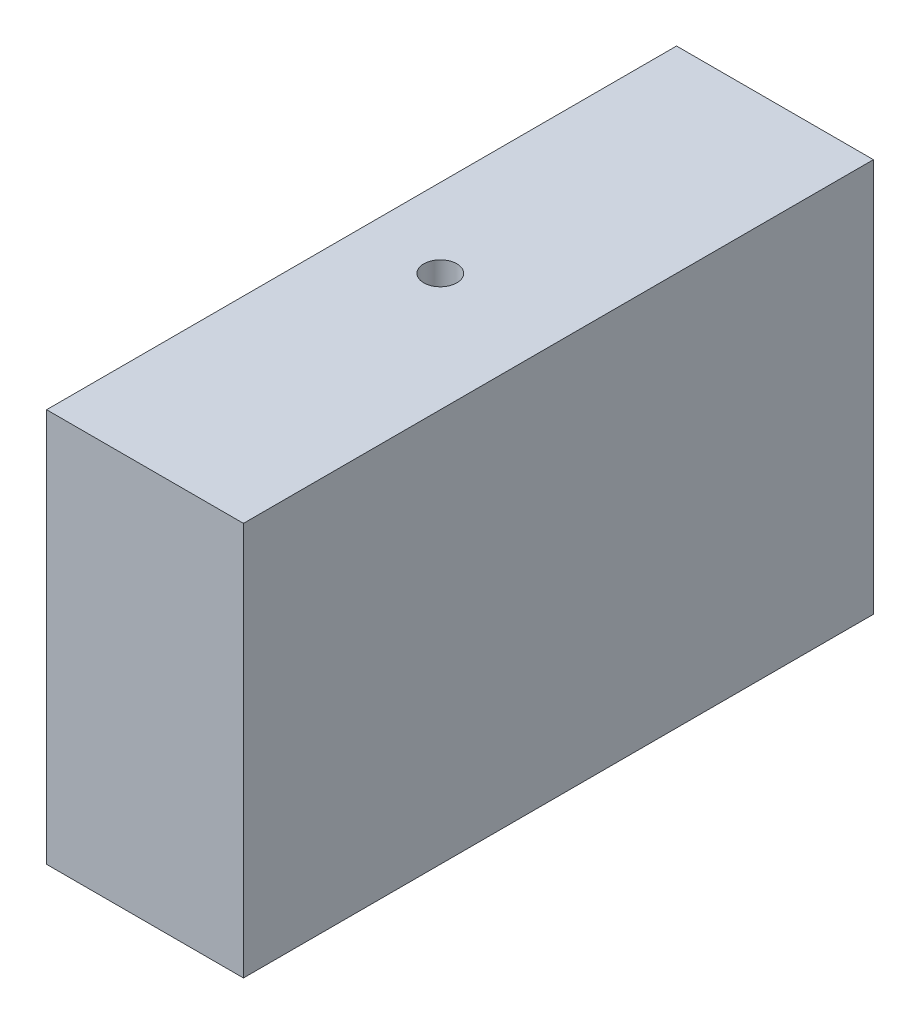
ISO-10303-21;
HEADER;
FILE_DESCRIPTION(('STEP AP214'),'2;1');
FILE_NAME('part.step','',(''),(''),'','','');
FILE_SCHEMA(('AUTOMOTIVE_DESIGN { 1 0 10303 214 1 1 1 1 }'));
ENDSEC;
DATA;
#1=APPLICATION_CONTEXT('core data for automotive mechanical design processes');
#2=APPLICATION_PROTOCOL_DEFINITION('international standard','automotive_design',2000,#1);
#3=PRODUCT_CONTEXT('',#1,'mechanical');
#4=PRODUCT('Part','Part','',(#3));
#5=PRODUCT_RELATED_PRODUCT_CATEGORY('part','',(#4));
#6=PRODUCT_DEFINITION_FORMATION('','',#4);
#7=PRODUCT_DEFINITION_CONTEXT('part definition',#1,'design');
#8=PRODUCT_DEFINITION('design','',#6,#7);
#9=PRODUCT_DEFINITION_SHAPE('','',#8);
#10=(LENGTH_UNIT() NAMED_UNIT(*) SI_UNIT(.MILLI.,.METRE.));
#11=(NAMED_UNIT(*) PLANE_ANGLE_UNIT() SI_UNIT($,.RADIAN.));
#12=(NAMED_UNIT(*) SI_UNIT($,.STERADIAN.) SOLID_ANGLE_UNIT());
#13=UNCERTAINTY_MEASURE_WITH_UNIT(LENGTH_MEASURE(1.E-05),#10,'distance_accuracy_value','');
#14=(GEOMETRIC_REPRESENTATION_CONTEXT(3) GLOBAL_UNCERTAINTY_ASSIGNED_CONTEXT((#13)) GLOBAL_UNIT_ASSIGNED_CONTEXT((#10,
#11,#12)) REPRESENTATION_CONTEXT('',''));
#15=CARTESIAN_POINT('',(0.,0.,0.));
#16=DIRECTION('',(0.,0.,1.));
#17=DIRECTION('',(1.,0.,0.));
#18=AXIS2_PLACEMENT_3D('',#15,#16,#17);
#19=CARTESIAN_POINT('',(-31.6318162864007,-17.693795620438,80.));
#20=DIRECTION('',(1.,0.,0.));
#21=DIRECTION('',(0.,0.,-1.));
#22=AXIS2_PLACEMENT_3D('',#19,#20,#21);
#23=PLANE('',#22);
#24=DIRECTION('',(0.,-1.,0.));
#25=VECTOR('',#24,1.);
#26=CARTESIAN_POINT('',(-31.6318162864007,-17.693795620438,0.));
#27=LINE('',#26,#25);
#28=CARTESIAN_POINT('',(-31.6318162864007,32.306204379562,0.));
#29=VERTEX_POINT('',#28);
#30=CARTESIAN_POINT('',(-31.6318162864007,-17.693795620438,0.));
#31=VERTEX_POINT('',#30);
#32=EDGE_CURVE('E108',#29,#31,#27,.T.);
#33=ORIENTED_EDGE('',*,*,#32,.T.);
#34=DIRECTION('',(0.,0.,-1.));
#35=VECTOR('',#34,1.);
#36=CARTESIAN_POINT('',(-31.6318162864007,-17.693795620438,80.));
#37=LINE('',#36,#35);
#38=CARTESIAN_POINT('',(-31.6318162864007,-17.693795620438,80.));
#39=VERTEX_POINT('',#38);
#40=EDGE_CURVE('E11',#39,#31,#37,.T.);
#41=ORIENTED_EDGE('',*,*,#40,.F.);
#42=DIRECTION('',(0.,-1.,0.));
#43=VECTOR('',#42,1.);
#44=CARTESIAN_POINT('',(-31.6318162864007,-17.693795620438,80.));
#45=LINE('',#44,#43);
#46=CARTESIAN_POINT('',(-31.6318162864007,32.306204379562,80.));
#47=VERTEX_POINT('',#46);
#48=EDGE_CURVE('E109',#47,#39,#45,.T.);
#49=ORIENTED_EDGE('',*,*,#48,.F.);
#50=DIRECTION('',(0.,0.,-1.));
#51=VECTOR('',#50,1.);
#52=CARTESIAN_POINT('',(-31.6318162864007,32.306204379562,80.));
#53=LINE('',#52,#51);
#54=EDGE_CURVE('E115',#47,#29,#53,.T.);
#55=ORIENTED_EDGE('',*,*,#54,.T.);
#56=EDGE_LOOP('',(#33,#41,#49,#55));
#57=FACE_BOUND('',#56,.T.);
#58=ADVANCED_FACE('F33',(#57),#23,.F.);
#59=CARTESIAN_POINT('',(-6.63181628640069,-17.693795620438,80.));
#60=DIRECTION('',(0.,1.,0.));
#61=DIRECTION('',(0.,0.,1.));
#62=AXIS2_PLACEMENT_3D('',#59,#60,#61);
#63=PLANE('',#62);
#64=CARTESIAN_POINT('',(-21.6318162864007,-17.693795620438,40.));
#65=DIRECTION('',(0.,-1.,0.));
#66=DIRECTION('',(0.,0.,-1.));
#67=AXIS2_PLACEMENT_3D('',#64,#65,#66);
#68=CIRCLE('',#67,2.09999999999999);
#69=CARTESIAN_POINT('',(-21.6318162864007,-17.693795620438,37.9));
#70=VERTEX_POINT('',#69);
#71=EDGE_CURVE('E98',#70,#70,#68,.T.);
#72=ORIENTED_EDGE('',*,*,#71,.F.);
#73=EDGE_LOOP('',(#72));
#74=FACE_BOUND('',#73,.T.);
#75=DIRECTION('',(1.,0.,0.));
#76=VECTOR('',#75,1.);
#77=CARTESIAN_POINT('',(-6.63181628640069,-17.693795620438,0.));
#78=LINE('',#77,#76);
#79=CARTESIAN_POINT('',(-6.63181628640069,-17.693795620438,0.));
#80=VERTEX_POINT('',#79);
#81=EDGE_CURVE('E118',#31,#80,#78,.T.);
#82=ORIENTED_EDGE('',*,*,#81,.T.);
#83=DIRECTION('',(0.,0.,-1.));
#84=VECTOR('',#83,1.);
#85=CARTESIAN_POINT('',(-6.63181628640069,-17.693795620438,80.));
#86=LINE('',#85,#84);
#87=CARTESIAN_POINT('',(-6.63181628640069,-17.693795620438,80.));
#88=VERTEX_POINT('',#87);
#89=EDGE_CURVE('E41',#88,#80,#86,.T.);
#90=ORIENTED_EDGE('',*,*,#89,.F.);
#91=DIRECTION('',(1.,0.,0.));
#92=VECTOR('',#91,1.);
#93=CARTESIAN_POINT('',(-6.63181628640069,-17.693795620438,80.));
#94=LINE('',#93,#92);
#95=EDGE_CURVE('E80',#39,#88,#94,.T.);
#96=ORIENTED_EDGE('',*,*,#95,.F.);
#97=ORIENTED_EDGE('',*,*,#40,.T.);
#98=EDGE_LOOP('',(#82,#90,#96,#97));
#99=FACE_BOUND('',#98,.T.);
#100=ADVANCED_FACE('F142',(#74,#99),#63,.F.);
#101=CARTESIAN_POINT('',(-6.63181628640069,32.306204379562,80.));
#102=DIRECTION('',(-1.,0.,0.));
#103=DIRECTION('',(0.,0.,1.));
#104=AXIS2_PLACEMENT_3D('',#101,#102,#103);
#105=PLANE('',#104);
#106=DIRECTION('',(0.,1.,0.));
#107=VECTOR('',#106,1.);
#108=CARTESIAN_POINT('',(-6.63181628640069,32.306204379562,0.));
#109=LINE('',#108,#107);
#110=CARTESIAN_POINT('',(-6.63181628640069,32.306204379562,0.));
#111=VERTEX_POINT('',#110);
#112=EDGE_CURVE('E67',#80,#111,#109,.T.);
#113=ORIENTED_EDGE('',*,*,#112,.T.);
#114=DIRECTION('',(0.,0.,-1.));
#115=VECTOR('',#114,1.);
#116=CARTESIAN_POINT('',(-6.63181628640069,32.306204379562,80.));
#117=LINE('',#116,#115);
#118=CARTESIAN_POINT('',(-6.63181628640069,32.306204379562,80.));
#119=VERTEX_POINT('',#118);
#120=EDGE_CURVE('E123',#119,#111,#117,.T.);
#121=ORIENTED_EDGE('',*,*,#120,.F.);
#122=DIRECTION('',(0.,1.,0.));
#123=VECTOR('',#122,1.);
#124=CARTESIAN_POINT('',(-6.63181628640069,32.306204379562,80.));
#125=LINE('',#124,#123);
#126=EDGE_CURVE('E112',#88,#119,#125,.T.);
#127=ORIENTED_EDGE('',*,*,#126,.F.);
#128=ORIENTED_EDGE('',*,*,#89,.T.);
#129=EDGE_LOOP('',(#113,#121,#127,#128));
#130=FACE_BOUND('',#129,.T.);
#131=ADVANCED_FACE('F125',(#130),#105,.F.);
#132=CARTESIAN_POINT('',(-31.6318162864007,32.306204379562,80.));
#133=DIRECTION('',(0.,-1.,0.));
#134=DIRECTION('',(0.,0.,-1.));
#135=AXIS2_PLACEMENT_3D('',#132,#133,#134);
#136=PLANE('',#135);
#137=CARTESIAN_POINT('',(-21.6318162864007,32.306204379562,40.));
#138=DIRECTION('',(0.,1.,0.));
#139=DIRECTION('',(0.,0.,1.));
#140=AXIS2_PLACEMENT_3D('',#137,#138,#139);
#141=CIRCLE('',#140,2.09999999999999);
#142=CARTESIAN_POINT('',(-21.6318162864007,32.306204379562,42.1));
#143=VERTEX_POINT('',#142);
#144=EDGE_CURVE('E97',#143,#143,#141,.T.);
#145=ORIENTED_EDGE('',*,*,#144,.F.);
#146=EDGE_LOOP('',(#145));
#147=FACE_BOUND('',#146,.T.);
#148=DIRECTION('',(-1.,0.,0.));
#149=VECTOR('',#148,1.);
#150=CARTESIAN_POINT('',(-31.6318162864007,32.306204379562,0.));
#151=LINE('',#150,#149);
#152=EDGE_CURVE('E73',#111,#29,#151,.T.);
#153=ORIENTED_EDGE('',*,*,#152,.T.);
#154=ORIENTED_EDGE('',*,*,#54,.F.);
#155=DIRECTION('',(-1.,0.,0.));
#156=VECTOR('',#155,1.);
#157=CARTESIAN_POINT('',(-31.6318162864007,32.306204379562,80.));
#158=LINE('',#157,#156);
#159=EDGE_CURVE('E49',#119,#47,#158,.T.);
#160=ORIENTED_EDGE('',*,*,#159,.F.);
#161=ORIENTED_EDGE('',*,*,#120,.T.);
#162=EDGE_LOOP('',(#153,#154,#160,#161));
#163=FACE_BOUND('',#162,.T.);
#164=ADVANCED_FACE('F132',(#147,#163),#136,.F.);
#165=CARTESIAN_POINT('',(0.,0.,80.));
#166=DIRECTION('',(0.,0.,-1.));
#167=DIRECTION('',(-1.,0.,0.));
#168=AXIS2_PLACEMENT_3D('',#165,#166,#167);
#169=PLANE('',#168);
#170=ORIENTED_EDGE('',*,*,#48,.T.);
#171=ORIENTED_EDGE('',*,*,#95,.T.);
#172=ORIENTED_EDGE('',*,*,#126,.T.);
#173=ORIENTED_EDGE('',*,*,#159,.T.);
#174=EDGE_LOOP('',(#170,#171,#172,#173));
#175=FACE_BOUND('',#174,.T.);
#176=ADVANCED_FACE('F134',(#175),#169,.F.);
#177=CARTESIAN_POINT('',(0.,0.,0.));
#178=DIRECTION('',(0.,0.,-1.));
#179=DIRECTION('',(-1.,0.,0.));
#180=AXIS2_PLACEMENT_3D('',#177,#178,#179);
#181=PLANE('',#180);
#182=ORIENTED_EDGE('',*,*,#32,.F.);
#183=ORIENTED_EDGE('',*,*,#152,.F.);
#184=ORIENTED_EDGE('',*,*,#112,.F.);
#185=ORIENTED_EDGE('',*,*,#81,.F.);
#186=EDGE_LOOP('',(#182,#183,#184,#185));
#187=FACE_BOUND('',#186,.T.);
#188=ADVANCED_FACE('F128',(#187),#181,.T.);
#189=CARTESIAN_POINT('',(-21.6318162864007,21.306204379562,40.));
#190=DIRECTION('',(0.,1.,0.));
#191=DIRECTION('',(0.,0.,1.));
#192=AXIS2_PLACEMENT_3D('',#189,#190,#191);
#193=CONICAL_SURFACE('',#192,2.09999999999999,1.02974425867665);
#194=CARTESIAN_POINT('',(-21.6318162864007,20.0443970796042,40.));
#195=VERTEX_POINT('',#194);
#196=VERTEX_LOOP('',#195);
#197=FACE_BOUND('',#196,.T.);
#198=CARTESIAN_POINT('',(-21.6318162864007,21.306204379562,40.));
#199=DIRECTION('',(0.,1.,0.));
#200=DIRECTION('',(0.,0.,1.));
#201=AXIS2_PLACEMENT_3D('',#198,#199,#200);
#202=CIRCLE('',#201,2.09999999999999);
#203=CARTESIAN_POINT('',(-21.6318162864007,21.306204379562,42.1));
#204=VERTEX_POINT('',#203);
#205=EDGE_CURVE('E101',#204,#204,#202,.T.);
#206=ORIENTED_EDGE('',*,*,#205,.T.);
#207=EDGE_LOOP('',(#206));
#208=FACE_BOUND('',#207,.T.);
#209=ADVANCED_FACE('F162',(#197,#208),#193,.F.);
#210=CARTESIAN_POINT('',(-21.6318162864007,32.306204379562,40.));
#211=DIRECTION('',(0.,1.,0.));
#212=DIRECTION('',(0.,0.,1.));
#213=AXIS2_PLACEMENT_3D('',#210,#211,#212);
#214=CYLINDRICAL_SURFACE('',#213,2.09999999999999);
#215=ORIENTED_EDGE('',*,*,#205,.F.);
#216=EDGE_LOOP('',(#215));
#217=FACE_BOUND('',#216,.T.);
#218=ORIENTED_EDGE('',*,*,#144,.T.);
#219=EDGE_LOOP('',(#218));
#220=FACE_BOUND('',#219,.T.);
#221=ADVANCED_FACE('F91',(#217,#220),#214,.F.);
#222=CARTESIAN_POINT('',(-21.6318162864007,-6.69379562043797,40.));
#223=DIRECTION('',(0.,-1.,0.));
#224=DIRECTION('',(0.,0.,-1.));
#225=AXIS2_PLACEMENT_3D('',#222,#223,#224);
#226=CONICAL_SURFACE('',#225,2.09999999999999,1.02974425867665);
#227=CARTESIAN_POINT('',(-21.6318162864007,-5.4319883204801,40.));
#228=VERTEX_POINT('',#227);
#229=VERTEX_LOOP('',#228);
#230=FACE_BOUND('',#229,.T.);
#231=CARTESIAN_POINT('',(-21.6318162864007,-6.69379562043797,40.));
#232=DIRECTION('',(0.,-1.,0.));
#233=DIRECTION('',(0.,0.,-1.));
#234=AXIS2_PLACEMENT_3D('',#231,#232,#233);
#235=CIRCLE('',#234,2.09999999999999);
#236=CARTESIAN_POINT('',(-21.6318162864007,-6.69379562043797,37.9));
#237=VERTEX_POINT('',#236);
#238=EDGE_CURVE('E95',#237,#237,#235,.T.);
#239=ORIENTED_EDGE('',*,*,#238,.T.);
#240=EDGE_LOOP('',(#239));
#241=FACE_BOUND('',#240,.T.);
#242=ADVANCED_FACE('F87',(#230,#241),#226,.F.);
#243=CARTESIAN_POINT('',(-21.6318162864007,-17.693795620438,40.));
#244=DIRECTION('',(0.,-1.,0.));
#245=DIRECTION('',(0.,0.,-1.));
#246=AXIS2_PLACEMENT_3D('',#243,#244,#245);
#247=CYLINDRICAL_SURFACE('',#246,2.09999999999999);
#248=ORIENTED_EDGE('',*,*,#238,.F.);
#249=EDGE_LOOP('',(#248));
#250=FACE_BOUND('',#249,.T.);
#251=ORIENTED_EDGE('',*,*,#71,.T.);
#252=EDGE_LOOP('',(#251));
#253=FACE_BOUND('',#252,.T.);
#254=ADVANCED_FACE('F90',(#250,#253),#247,.F.);
#255=CLOSED_SHELL('',(#58,#100,#131,#164,#176,#188,#209,#221,#242,#254));
#256=MANIFOLD_SOLID_BREP('B2',#255);
#257=ADVANCED_BREP_SHAPE_REPRESENTATION('',(#18,#256),#14);
#258=SHAPE_DEFINITION_REPRESENTATION(#9,#257);
ENDSEC;
END-ISO-10303-21;
